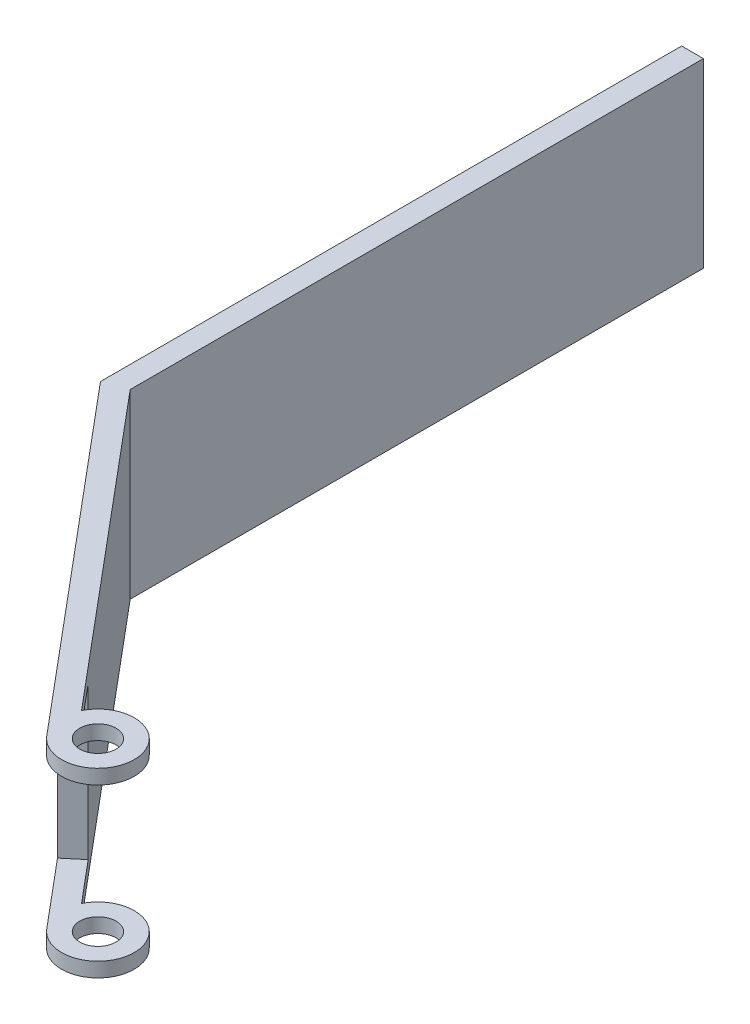
ISO-10303-21;
HEADER;
FILE_DESCRIPTION(('STEP AP214'),'2;1');
FILE_NAME('part.step','',(''),(''),'','','');
FILE_SCHEMA(('AUTOMOTIVE_DESIGN { 1 0 10303 214 1 1 1 1 }'));
ENDSEC;
DATA;
#1=APPLICATION_CONTEXT('core data for automotive mechanical design processes');
#2=APPLICATION_PROTOCOL_DEFINITION('international standard','automotive_design',2000,#1);
#3=PRODUCT_CONTEXT('',#1,'mechanical');
#4=PRODUCT('Part','Part','',(#3));
#5=PRODUCT_RELATED_PRODUCT_CATEGORY('part','',(#4));
#6=PRODUCT_DEFINITION_FORMATION('','',#4);
#7=PRODUCT_DEFINITION_CONTEXT('part definition',#1,'design');
#8=PRODUCT_DEFINITION('design','',#6,#7);
#9=PRODUCT_DEFINITION_SHAPE('','',#8);
#10=(LENGTH_UNIT() NAMED_UNIT(*) SI_UNIT(.MILLI.,.METRE.));
#11=(NAMED_UNIT(*) PLANE_ANGLE_UNIT() SI_UNIT($,.RADIAN.));
#12=(NAMED_UNIT(*) SI_UNIT($,.STERADIAN.) SOLID_ANGLE_UNIT());
#13=UNCERTAINTY_MEASURE_WITH_UNIT(LENGTH_MEASURE(1.E-05),#10,'distance_accuracy_value','');
#14=(GEOMETRIC_REPRESENTATION_CONTEXT(3) GLOBAL_UNCERTAINTY_ASSIGNED_CONTEXT((#13)) GLOBAL_UNIT_ASSIGNED_CONTEXT((#10,
#11,#12)) REPRESENTATION_CONTEXT('',''));
#15=CARTESIAN_POINT('',(0.,0.,0.));
#16=DIRECTION('',(0.,0.,1.));
#17=DIRECTION('',(1.,0.,0.));
#18=AXIS2_PLACEMENT_3D('',#15,#16,#17);
#19=CARTESIAN_POINT('',(39.3974787967873,25.,122.748728538706));
#20=DIRECTION('',(0.,-1.,0.));
#21=DIRECTION('',(0.,0.,-1.));
#22=AXIS2_PLACEMENT_3D('',#19,#20,#21);
#23=CYLINDRICAL_SURFACE('',#22,5.);
#24=DIRECTION('',(0.,-1.,0.));
#25=VECTOR('',#24,1.);
#26=CARTESIAN_POINT('',(35.5672565811924,25.,125.962666587139));
#27=LINE('',#26,#25);
#28=CARTESIAN_POINT('',(35.5672565811924,25.,125.962666587139));
#29=VERTEX_POINT('',#28);
#30=CARTESIAN_POINT('',(35.5672565811924,23.,125.962666587139));
#31=VERTEX_POINT('',#30);
#32=EDGE_CURVE('E114',#29,#31,#27,.T.);
#33=ORIENTED_EDGE('',*,*,#32,.T.);
#34=CARTESIAN_POINT('',(39.3974787967873,23.,122.748728538706));
#35=DIRECTION('',(0.,1.,0.));
#36=DIRECTION('',(0.,0.,1.));
#37=AXIS2_PLACEMENT_3D('',#34,#35,#36);
#38=CIRCLE('',#37,5.);
#39=CARTESIAN_POINT('',(34.9197670333811,23.,120.523847111786));
#40=VERTEX_POINT('',#39);
#41=EDGE_CURVE('E166',#31,#40,#38,.T.);
#42=ORIENTED_EDGE('',*,*,#41,.T.);
#43=DIRECTION('',(0.,-1.,0.));
#44=VECTOR('',#43,1.);
#45=CARTESIAN_POINT('',(34.9197670333811,25.,120.523847111786));
#46=LINE('',#45,#44);
#47=CARTESIAN_POINT('',(34.9197670333811,25.,120.523847111786));
#48=VERTEX_POINT('',#47);
#49=EDGE_CURVE('E126',#48,#40,#46,.T.);
#50=ORIENTED_EDGE('',*,*,#49,.F.);
#51=CARTESIAN_POINT('',(39.3974787967873,25.,122.748728538706));
#52=DIRECTION('',(0.,1.,0.));
#53=DIRECTION('',(0.,0.,1.));
#54=AXIS2_PLACEMENT_3D('',#51,#52,#53);
#55=CIRCLE('',#54,5.);
#56=EDGE_CURVE('E104',#29,#48,#55,.T.);
#57=ORIENTED_EDGE('',*,*,#56,.F.);
#58=EDGE_LOOP('',(#33,#42,#50,#57));
#59=FACE_BOUND('',#58,.T.);
#60=ADVANCED_FACE('F31',(#59),#23,.T.);
#61=CARTESIAN_POINT('',(39.3974787967873,25.,122.748728538706));
#62=DIRECTION('',(0.,-1.,0.));
#63=DIRECTION('',(0.,0.,-1.));
#64=AXIS2_PLACEMENT_3D('',#61,#62,#63);
#65=CYLINDRICAL_SURFACE('',#64,2.5);
#66=CARTESIAN_POINT('',(39.3974787967873,23.,122.748728538706));
#67=DIRECTION('',(0.,1.,0.));
#68=DIRECTION('',(0.,0.,1.));
#69=AXIS2_PLACEMENT_3D('',#66,#67,#68);
#70=CIRCLE('',#69,2.5);
#71=CARTESIAN_POINT('',(39.3974787967873,23.,125.248728538706));
#72=VERTEX_POINT('',#71);
#73=EDGE_CURVE('E160',#72,#72,#70,.T.);
#74=ORIENTED_EDGE('',*,*,#73,.F.);
#75=EDGE_LOOP('',(#74));
#76=FACE_BOUND('',#75,.T.);
#77=CARTESIAN_POINT('',(39.3974787967873,25.,122.748728538706));
#78=DIRECTION('',(0.,1.,0.));
#79=DIRECTION('',(0.,0.,1.));
#80=AXIS2_PLACEMENT_3D('',#77,#78,#79);
#81=CIRCLE('',#80,2.5);
#82=CARTESIAN_POINT('',(39.3974787967873,25.,125.248728538706));
#83=VERTEX_POINT('',#82);
#84=EDGE_CURVE('E136',#83,#83,#81,.T.);
#85=ORIENTED_EDGE('',*,*,#84,.T.);
#86=EDGE_LOOP('',(#85));
#87=FACE_BOUND('',#86,.T.);
#88=ADVANCED_FACE('F226',(#76,#87),#65,.F.);
#89=CARTESIAN_POINT('',(39.3974787967873,25.,122.748728538706));
#90=DIRECTION('',(0.,1.,0.));
#91=DIRECTION('',(0.,0.,1.));
#92=AXIS2_PLACEMENT_3D('',#89,#90,#91);
#93=PLANE('',#92);
#94=DIRECTION('',(0.,0.,-1.));
#95=VECTOR('',#94,1.);
#96=CARTESIAN_POINT('',(0.,25.,0.));
#97=LINE('',#96,#95);
#98=CARTESIAN_POINT('',(0.,25.,78.9080892972014));
#99=VERTEX_POINT('',#98);
#100=CARTESIAN_POINT('',(0.,25.,0.));
#101=VERTEX_POINT('',#100);
#102=EDGE_CURVE('E147',#99,#101,#97,.T.);
#103=ORIENTED_EDGE('',*,*,#102,.T.);
#104=DIRECTION('',(-1.,0.,0.));
#105=VECTOR('',#104,1.);
#106=CARTESIAN_POINT('',(0.,25.,0.));
#107=LINE('',#106,#105);
#108=CARTESIAN_POINT('',(-3.,25.,0.));
#109=VERTEX_POINT('',#108);
#110=EDGE_CURVE('E90',#101,#109,#107,.T.);
#111=ORIENTED_EDGE('',*,*,#110,.T.);
#112=DIRECTION('',(0.,0.,1.));
#113=VECTOR('',#112,1.);
#114=CARTESIAN_POINT('',(-3.,25.,0.));
#115=LINE('',#114,#113);
#116=CARTESIAN_POINT('',(-2.99999999999999,25.,80.));
#117=VERTEX_POINT('',#116);
#118=EDGE_CURVE('E107',#109,#117,#115,.T.);
#119=ORIENTED_EDGE('',*,*,#118,.T.);
#120=DIRECTION('',(0.64278760968654,0.,0.766044443118977));
#121=VECTOR('',#120,1.);
#122=CARTESIAN_POINT('',(35.5672565811924,25.,125.962666587139));
#123=LINE('',#122,#121);
#124=EDGE_CURVE('E99',#117,#29,#123,.T.);
#125=ORIENTED_EDGE('',*,*,#124,.T.);
#126=ORIENTED_EDGE('',*,*,#56,.T.);
#127=DIRECTION('',(-0.642787609686541,0.,-0.766044443118977));
#128=VECTOR('',#127,1.);
#129=CARTESIAN_POINT('',(0.,25.,78.9080892972014));
#130=LINE('',#129,#128);
#131=EDGE_CURVE('E55',#48,#99,#130,.T.);
#132=ORIENTED_EDGE('',*,*,#131,.T.);
#133=EDGE_LOOP('',(#103,#111,#119,#125,#126,#132));
#134=FACE_BOUND('',#133,.T.);
#135=ORIENTED_EDGE('',*,*,#84,.F.);
#136=EDGE_LOOP('',(#135));
#137=FACE_BOUND('',#136,.T.);
#138=ADVANCED_FACE('F101',(#134,#137),#93,.T.);
#139=CARTESIAN_POINT('',(39.3974787967873,0.,122.748728538706));
#140=DIRECTION('',(0.,1.,0.));
#141=DIRECTION('',(0.,0.,1.));
#142=AXIS2_PLACEMENT_3D('',#139,#140,#141);
#143=PLANE('',#142);
#144=DIRECTION('',(0.,0.,-1.));
#145=VECTOR('',#144,1.);
#146=CARTESIAN_POINT('',(0.,0.,0.));
#147=LINE('',#146,#145);
#148=CARTESIAN_POINT('',(0.,0.,78.9080892972014));
#149=VERTEX_POINT('',#148);
#150=CARTESIAN_POINT('',(0.,0.,0.));
#151=VERTEX_POINT('',#150);
#152=EDGE_CURVE('E132',#149,#151,#147,.T.);
#153=ORIENTED_EDGE('',*,*,#152,.F.);
#154=DIRECTION('',(-0.642787609686541,0.,-0.766044443118977));
#155=VECTOR('',#154,1.);
#156=CARTESIAN_POINT('',(0.,0.,78.9080892972014));
#157=LINE('',#156,#155);
#158=CARTESIAN_POINT('',(34.9197670333811,0.,120.523847111786));
#159=VERTEX_POINT('',#158);
#160=EDGE_CURVE('E81',#159,#149,#157,.T.);
#161=ORIENTED_EDGE('',*,*,#160,.F.);
#162=CARTESIAN_POINT('',(39.3974787967873,0.,122.748728538706));
#163=DIRECTION('',(0.,1.,0.));
#164=DIRECTION('',(0.,0.,1.));
#165=AXIS2_PLACEMENT_3D('',#162,#163,#164);
#166=CIRCLE('',#165,5.);
#167=CARTESIAN_POINT('',(35.5672565811924,0.,125.962666587139));
#168=VERTEX_POINT('',#167);
#169=EDGE_CURVE('E143',#168,#159,#166,.T.);
#170=ORIENTED_EDGE('',*,*,#169,.F.);
#171=DIRECTION('',(0.64278760968654,0.,0.766044443118977));
#172=VECTOR('',#171,1.);
#173=CARTESIAN_POINT('',(35.5672565811924,0.,125.962666587139));
#174=LINE('',#173,#172);
#175=CARTESIAN_POINT('',(-2.99999999999999,0.,80.));
#176=VERTEX_POINT('',#175);
#177=EDGE_CURVE('E140',#176,#168,#174,.T.);
#178=ORIENTED_EDGE('',*,*,#177,.F.);
#179=DIRECTION('',(0.,0.,1.));
#180=VECTOR('',#179,1.);
#181=CARTESIAN_POINT('',(-3.,0.,0.));
#182=LINE('',#181,#180);
#183=CARTESIAN_POINT('',(-3.,0.,0.));
#184=VERTEX_POINT('',#183);
#185=EDGE_CURVE('E138',#184,#176,#182,.T.);
#186=ORIENTED_EDGE('',*,*,#185,.F.);
#187=DIRECTION('',(-1.,0.,0.));
#188=VECTOR('',#187,1.);
#189=CARTESIAN_POINT('',(0.,0.,0.));
#190=LINE('',#189,#188);
#191=EDGE_CURVE('E135',#151,#184,#190,.T.);
#192=ORIENTED_EDGE('',*,*,#191,.F.);
#193=EDGE_LOOP('',(#153,#161,#170,#178,#186,#192));
#194=FACE_BOUND('',#193,.T.);
#195=CARTESIAN_POINT('',(39.3974787967873,0.,122.748728538706));
#196=DIRECTION('',(0.,1.,0.));
#197=DIRECTION('',(0.,0.,1.));
#198=AXIS2_PLACEMENT_3D('',#195,#196,#197);
#199=CIRCLE('',#198,2.5);
#200=CARTESIAN_POINT('',(39.3974787967873,0.,125.248728538706));
#201=VERTEX_POINT('',#200);
#202=EDGE_CURVE('E177',#201,#201,#199,.T.);
#203=ORIENTED_EDGE('',*,*,#202,.T.);
#204=EDGE_LOOP('',(#203));
#205=FACE_BOUND('',#204,.T.);
#206=ADVANCED_FACE('F193',(#194,#205),#143,.F.);
#207=CARTESIAN_POINT('',(0.,25.,0.));
#208=DIRECTION('',(-1.,0.,0.));
#209=DIRECTION('',(0.,0.,1.));
#210=AXIS2_PLACEMENT_3D('',#207,#208,#209);
#211=PLANE('',#210);
#212=ORIENTED_EDGE('',*,*,#152,.T.);
#213=DIRECTION('',(0.,-1.,0.));
#214=VECTOR('',#213,1.);
#215=CARTESIAN_POINT('',(0.,25.,0.));
#216=LINE('',#215,#214);
#217=EDGE_CURVE('E39',#101,#151,#216,.T.);
#218=ORIENTED_EDGE('',*,*,#217,.F.);
#219=ORIENTED_EDGE('',*,*,#102,.F.);
#220=DIRECTION('',(0.,-1.,0.));
#221=VECTOR('',#220,1.);
#222=CARTESIAN_POINT('',(0.,25.,78.9080892972014));
#223=LINE('',#222,#221);
#224=EDGE_CURVE('E128',#99,#149,#223,.T.);
#225=ORIENTED_EDGE('',*,*,#224,.T.);
#226=EDGE_LOOP('',(#212,#218,#219,#225));
#227=FACE_BOUND('',#226,.T.);
#228=ADVANCED_FACE('F33',(#227),#211,.F.);
#229=CARTESIAN_POINT('',(0.,25.,0.));
#230=DIRECTION('',(0.,0.,1.));
#231=DIRECTION('',(1.,0.,0.));
#232=AXIS2_PLACEMENT_3D('',#229,#230,#231);
#233=PLANE('',#232);
#234=ORIENTED_EDGE('',*,*,#191,.T.);
#235=DIRECTION('',(0.,-1.,0.));
#236=VECTOR('',#235,1.);
#237=CARTESIAN_POINT('',(-3.,25.,0.));
#238=LINE('',#237,#236);
#239=EDGE_CURVE('E152',#109,#184,#238,.T.);
#240=ORIENTED_EDGE('',*,*,#239,.F.);
#241=ORIENTED_EDGE('',*,*,#110,.F.);
#242=ORIENTED_EDGE('',*,*,#217,.T.);
#243=EDGE_LOOP('',(#234,#240,#241,#242));
#244=FACE_BOUND('',#243,.T.);
#245=ADVANCED_FACE('F185',(#244),#233,.F.);
#246=CARTESIAN_POINT('',(-3.,25.,0.));
#247=DIRECTION('',(1.,0.,0.));
#248=DIRECTION('',(0.,0.,-1.));
#249=AXIS2_PLACEMENT_3D('',#246,#247,#248);
#250=PLANE('',#249);
#251=ORIENTED_EDGE('',*,*,#185,.T.);
#252=DIRECTION('',(0.,-1.,0.));
#253=VECTOR('',#252,1.);
#254=CARTESIAN_POINT('',(-2.99999999999999,25.,80.));
#255=LINE('',#254,#253);
#256=EDGE_CURVE('E122',#117,#176,#255,.T.);
#257=ORIENTED_EDGE('',*,*,#256,.F.);
#258=ORIENTED_EDGE('',*,*,#118,.F.);
#259=ORIENTED_EDGE('',*,*,#239,.T.);
#260=EDGE_LOOP('',(#251,#257,#258,#259));
#261=FACE_BOUND('',#260,.T.);
#262=ADVANCED_FACE('F188',(#261),#250,.F.);
#263=CARTESIAN_POINT('',(35.5672565811924,25.,125.962666587139));
#264=DIRECTION('',(0.766044443118977,0.,-0.64278760968654));
#265=DIRECTION('',(-0.64278760968654,0.,-0.766044443118977));
#266=AXIS2_PLACEMENT_3D('',#263,#264,#265);
#267=PLANE('',#266);
#268=DIRECTION('',(0.,-1.,0.));
#269=VECTOR('',#268,1.);
#270=CARTESIAN_POINT('',(27.8538052649539,2.,116.770133269711));
#271=LINE('',#270,#269);
#272=CARTESIAN_POINT('',(27.8538052649539,23.,116.770133269711));
#273=VERTEX_POINT('',#272);
#274=CARTESIAN_POINT('',(27.8538052649539,2.,116.770133269711));
#275=VERTEX_POINT('',#274);
#276=EDGE_CURVE('E333',#273,#275,#271,.T.);
#277=ORIENTED_EDGE('',*,*,#276,.F.);
#278=DIRECTION('',(-0.642787609686541,0.,-0.766044443118977));
#279=VECTOR('',#278,1.);
#280=CARTESIAN_POINT('',(27.8538052649539,23.,116.770133269711));
#281=LINE('',#280,#279);
#282=EDGE_CURVE('E119',#31,#273,#281,.T.);
#283=ORIENTED_EDGE('',*,*,#282,.F.);
#284=ORIENTED_EDGE('',*,*,#32,.F.);
#285=ORIENTED_EDGE('',*,*,#124,.F.);
#286=ORIENTED_EDGE('',*,*,#256,.T.);
#287=ORIENTED_EDGE('',*,*,#177,.T.);
#288=CARTESIAN_POINT('',(35.5672565811924,2.,125.962666587139));
#289=VERTEX_POINT('',#288);
#290=EDGE_CURVE('E123',#289,#168,#27,.T.);
#291=ORIENTED_EDGE('',*,*,#290,.F.);
#292=DIRECTION('',(0.642787609686541,0.,0.766044443118977));
#293=VECTOR('',#292,1.);
#294=CARTESIAN_POINT('',(47.1374335555502,2.,139.75146656328));
#295=LINE('',#294,#293);
#296=EDGE_CURVE('E198',#275,#289,#295,.T.);
#297=ORIENTED_EDGE('',*,*,#296,.F.);
#298=EDGE_LOOP('',(#277,#283,#284,#285,#286,#287,#291,#297));
#299=FACE_BOUND('',#298,.T.);
#300=ADVANCED_FACE('F116',(#299),#267,.F.);
#301=CARTESIAN_POINT('',(34.9197670333811,2.,120.523847111786));
#302=VERTEX_POINT('',#301);
#303=EDGE_CURVE('E149',#302,#159,#46,.T.);
#304=ORIENTED_EDGE('',*,*,#303,.F.);
#305=CARTESIAN_POINT('',(39.3974787967873,2.,122.748728538706));
#306=DIRECTION('',(0.,-1.,0.));
#307=DIRECTION('',(0.,0.,-1.));
#308=AXIS2_PLACEMENT_3D('',#305,#306,#307);
#309=CIRCLE('',#308,5.);
#310=EDGE_CURVE('E46',#302,#289,#309,.T.);
#311=ORIENTED_EDGE('',*,*,#310,.T.);
#312=ORIENTED_EDGE('',*,*,#290,.T.);
#313=ORIENTED_EDGE('',*,*,#169,.T.);
#314=EDGE_LOOP('',(#304,#311,#312,#313));
#315=FACE_BOUND('',#314,.T.);
#316=ADVANCED_FACE('F195',(#315),#23,.T.);
#317=CARTESIAN_POINT('',(0.,25.,78.9080892972014));
#318=DIRECTION('',(-0.766044443118977,0.,0.642787609686541));
#319=DIRECTION('',(0.642787609686541,0.,0.766044443118977));
#320=AXIS2_PLACEMENT_3D('',#317,#318,#319);
#321=PLANE('',#320);
#322=ORIENTED_EDGE('',*,*,#49,.T.);
#323=DIRECTION('',(-0.642787609686541,0.,-0.766044443118977));
#324=VECTOR('',#323,1.);
#325=CARTESIAN_POINT('',(0.,23.,78.9080892972014));
#326=LINE('',#325,#324);
#327=CARTESIAN_POINT('',(30.1519385943109,23.,114.841770440651));
#328=VERTEX_POINT('',#327);
#329=EDGE_CURVE('E162',#40,#328,#326,.T.);
#330=ORIENTED_EDGE('',*,*,#329,.T.);
#331=DIRECTION('',(0.,-1.,0.));
#332=VECTOR('',#331,1.);
#333=CARTESIAN_POINT('',(30.1519385943109,25.,114.841770440651));
#334=LINE('',#333,#332);
#335=CARTESIAN_POINT('',(30.1519385943109,2.,114.841770440651));
#336=VERTEX_POINT('',#335);
#337=EDGE_CURVE('E11',#328,#336,#334,.T.);
#338=ORIENTED_EDGE('',*,*,#337,.T.);
#339=DIRECTION('',(0.642787609686541,0.,0.766044443118977));
#340=VECTOR('',#339,1.);
#341=CARTESIAN_POINT('',(0.,1.99999999999999,78.9080892972014));
#342=LINE('',#341,#340);
#343=EDGE_CURVE('E158',#336,#302,#342,.T.);
#344=ORIENTED_EDGE('',*,*,#343,.T.);
#345=ORIENTED_EDGE('',*,*,#303,.T.);
#346=ORIENTED_EDGE('',*,*,#160,.T.);
#347=ORIENTED_EDGE('',*,*,#224,.F.);
#348=ORIENTED_EDGE('',*,*,#131,.F.);
#349=EDGE_LOOP('',(#322,#330,#338,#344,#345,#346,#347,#348));
#350=FACE_BOUND('',#349,.T.);
#351=ADVANCED_FACE('F217',(#350),#321,.F.);
#352=CARTESIAN_POINT('',(39.3974787967873,2.,122.748728538706));
#353=DIRECTION('',(0.,-1.,0.));
#354=DIRECTION('',(0.,0.,-1.));
#355=AXIS2_PLACEMENT_3D('',#352,#353,#354);
#356=CIRCLE('',#355,2.5);
#357=CARTESIAN_POINT('',(39.3974787967873,2.,120.248728538706));
#358=VERTEX_POINT('',#357);
#359=EDGE_CURVE('E156',#358,#358,#356,.T.);
#360=ORIENTED_EDGE('',*,*,#359,.F.);
#361=EDGE_LOOP('',(#360));
#362=FACE_BOUND('',#361,.T.);
#363=ORIENTED_EDGE('',*,*,#202,.F.);
#364=EDGE_LOOP('',(#363));
#365=FACE_BOUND('',#364,.T.);
#366=ADVANCED_FACE('F233',(#362,#365),#65,.F.);
#367=CARTESIAN_POINT('',(95.0600976933704,2.,60.3773580802341));
#368=DIRECTION('',(-0.64278760968654,0.,-0.766044443118977));
#369=DIRECTION('',(-0.766044443118977,0.,0.64278760968654));
#370=AXIS2_PLACEMENT_3D('',#367,#368,#369);
#371=PLANE('',#370);
#372=DIRECTION('',(-0.766044443118977,0.,0.64278760968654));
#373=VECTOR('',#372,1.);
#374=CARTESIAN_POINT('',(95.0600976933704,23.,60.377358080234));
#375=LINE('',#374,#373);
#376=EDGE_CURVE('E159',#328,#273,#375,.T.);
#377=ORIENTED_EDGE('',*,*,#376,.T.);
#378=ORIENTED_EDGE('',*,*,#276,.T.);
#379=DIRECTION('',(-0.766044443118977,0.,0.64278760968654));
#380=VECTOR('',#379,1.);
#381=CARTESIAN_POINT('',(95.0600976933704,2.,60.3773580802341));
#382=LINE('',#381,#380);
#383=EDGE_CURVE('E331',#336,#275,#382,.T.);
#384=ORIENTED_EDGE('',*,*,#383,.F.);
#385=ORIENTED_EDGE('',*,*,#337,.F.);
#386=EDGE_LOOP('',(#377,#378,#384,#385));
#387=FACE_BOUND('',#386,.T.);
#388=ADVANCED_FACE('F300',(#387),#371,.F.);
#389=CARTESIAN_POINT('',(95.0600976933704,23.,60.377358080234));
#390=DIRECTION('',(0.,1.,0.));
#391=DIRECTION('',(0.,0.,1.));
#392=AXIS2_PLACEMENT_3D('',#389,#390,#391);
#393=PLANE('',#392);
#394=ORIENTED_EDGE('',*,*,#73,.T.);
#395=EDGE_LOOP('',(#394));
#396=FACE_BOUND('',#395,.T.);
#397=ORIENTED_EDGE('',*,*,#282,.T.);
#398=ORIENTED_EDGE('',*,*,#376,.F.);
#399=ORIENTED_EDGE('',*,*,#329,.F.);
#400=ORIENTED_EDGE('',*,*,#41,.F.);
#401=EDGE_LOOP('',(#397,#398,#399,#400));
#402=FACE_BOUND('',#401,.T.);
#403=ADVANCED_FACE('F216',(#396,#402),#393,.F.);
#404=CARTESIAN_POINT('',(114.343725983967,2.,83.3586913738034));
#405=DIRECTION('',(0.,-1.,0.));
#406=DIRECTION('',(0.,0.,-1.));
#407=AXIS2_PLACEMENT_3D('',#404,#405,#406);
#408=PLANE('',#407);
#409=ORIENTED_EDGE('',*,*,#359,.T.);
#410=EDGE_LOOP('',(#409));
#411=FACE_BOUND('',#410,.T.);
#412=ORIENTED_EDGE('',*,*,#343,.F.);
#413=ORIENTED_EDGE('',*,*,#383,.T.);
#414=ORIENTED_EDGE('',*,*,#296,.T.);
#415=ORIENTED_EDGE('',*,*,#310,.F.);
#416=EDGE_LOOP('',(#412,#413,#414,#415));
#417=FACE_BOUND('',#416,.T.);
#418=ADVANCED_FACE('F317',(#411,#417),#408,.F.);
#419=CLOSED_SHELL('',(#60,#88,#138,#206,#228,#245,#262,#300,#316,#351,#366,#388,#403,#418));
#420=MANIFOLD_SOLID_BREP('B2',#419);
#421=ADVANCED_BREP_SHAPE_REPRESENTATION('',(#18,#420),#14);
#422=SHAPE_DEFINITION_REPRESENTATION(#9,#421);
ENDSEC;
END-ISO-10303-21;
